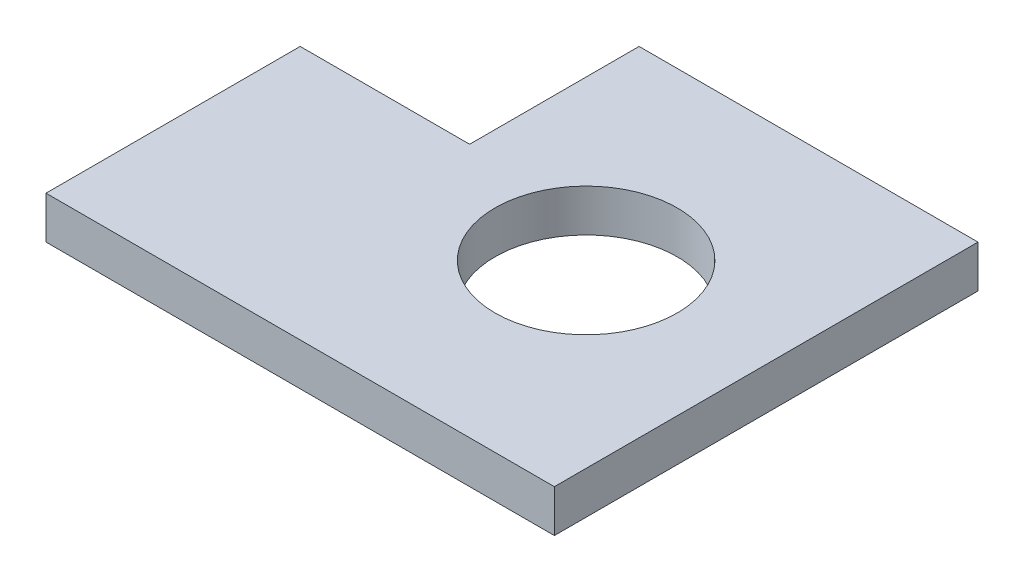
ISO-10303-21;
HEADER;
FILE_DESCRIPTION(('STEP AP214'),'2;1');
FILE_NAME('part.step','',(''),(''),'','','');
FILE_SCHEMA(('AUTOMOTIVE_DESIGN { 1 0 10303 214 1 1 1 1 }'));
ENDSEC;
DATA;
#1=APPLICATION_CONTEXT('core data for automotive mechanical design processes');
#2=APPLICATION_PROTOCOL_DEFINITION('international standard','automotive_design',2000,#1);
#3=PRODUCT_CONTEXT('',#1,'mechanical');
#4=PRODUCT('Part','Part','',(#3));
#5=PRODUCT_RELATED_PRODUCT_CATEGORY('part','',(#4));
#6=PRODUCT_DEFINITION_FORMATION('','',#4);
#7=PRODUCT_DEFINITION_CONTEXT('part definition',#1,'design');
#8=PRODUCT_DEFINITION('design','',#6,#7);
#9=PRODUCT_DEFINITION_SHAPE('','',#8);
#10=(LENGTH_UNIT() NAMED_UNIT(*) SI_UNIT(.MILLI.,.METRE.));
#11=(NAMED_UNIT(*) PLANE_ANGLE_UNIT() SI_UNIT($,.RADIAN.));
#12=(NAMED_UNIT(*) SI_UNIT($,.STERADIAN.) SOLID_ANGLE_UNIT());
#13=UNCERTAINTY_MEASURE_WITH_UNIT(LENGTH_MEASURE(1.E-05),#10,'distance_accuracy_value','');
#14=(GEOMETRIC_REPRESENTATION_CONTEXT(3) GLOBAL_UNCERTAINTY_ASSIGNED_CONTEXT((#13)) GLOBAL_UNIT_ASSIGNED_CONTEXT((#10,
#11,#12)) REPRESENTATION_CONTEXT('',''));
#15=CARTESIAN_POINT('',(0.,0.,0.));
#16=DIRECTION('',(0.,0.,1.));
#17=DIRECTION('',(1.,0.,0.));
#18=AXIS2_PLACEMENT_3D('',#15,#16,#17);
#19=CARTESIAN_POINT('',(0.,10.,0.));
#20=DIRECTION('',(0.,1.,0.));
#21=DIRECTION('',(0.,0.,1.));
#22=AXIS2_PLACEMENT_3D('',#19,#20,#21);
#23=PLANE('',#22);
#24=DIRECTION('',(0.,0.,1.));
#25=VECTOR('',#24,1.);
#26=CARTESIAN_POINT('',(0.,10.,-60.));
#27=LINE('',#26,#25);
#28=CARTESIAN_POINT('',(0.,10.,-60.));
#29=VERTEX_POINT('',#28);
#30=CARTESIAN_POINT('',(0.,10.,0.));
#31=VERTEX_POINT('',#30);
#32=EDGE_CURVE('E131',#29,#31,#27,.T.);
#33=ORIENTED_EDGE('',*,*,#32,.T.);
#34=DIRECTION('',(1.,0.,0.));
#35=VECTOR('',#34,1.);
#36=CARTESIAN_POINT('',(0.,10.,0.));
#37=LINE('',#36,#35);
#38=CARTESIAN_POINT('',(120.,10.,0.));
#39=VERTEX_POINT('',#38);
#40=EDGE_CURVE('E89',#31,#39,#37,.T.);
#41=ORIENTED_EDGE('',*,*,#40,.T.);
#42=DIRECTION('',(0.,0.,-1.));
#43=VECTOR('',#42,1.);
#44=CARTESIAN_POINT('',(120.,10.,0.));
#45=LINE('',#44,#43);
#46=CARTESIAN_POINT('',(120.,10.,-100.));
#47=VERTEX_POINT('',#46);
#48=EDGE_CURVE('E102',#39,#47,#45,.T.);
#49=ORIENTED_EDGE('',*,*,#48,.T.);
#50=DIRECTION('',(-1.,0.,0.));
#51=VECTOR('',#50,1.);
#52=CARTESIAN_POINT('',(120.,10.,-100.));
#53=LINE('',#52,#51);
#54=CARTESIAN_POINT('',(40.,10.,-100.));
#55=VERTEX_POINT('',#54);
#56=EDGE_CURVE('E96',#47,#55,#53,.T.);
#57=ORIENTED_EDGE('',*,*,#56,.T.);
#58=DIRECTION('',(0.,0.,1.));
#59=VECTOR('',#58,1.);
#60=CARTESIAN_POINT('',(40.,10.,-100.));
#61=LINE('',#60,#59);
#62=CARTESIAN_POINT('',(40.,10.,-60.));
#63=VERTEX_POINT('',#62);
#64=EDGE_CURVE('E100',#55,#63,#61,.T.);
#65=ORIENTED_EDGE('',*,*,#64,.T.);
#66=DIRECTION('',(-1.,0.,0.));
#67=VECTOR('',#66,1.);
#68=CARTESIAN_POINT('',(40.,10.,-60.));
#69=LINE('',#68,#67);
#70=EDGE_CURVE('E52',#63,#29,#69,.T.);
#71=ORIENTED_EDGE('',*,*,#70,.T.);
#72=EDGE_LOOP('',(#33,#41,#49,#57,#65,#71));
#73=FACE_BOUND('',#72,.T.);
#74=CARTESIAN_POINT('',(77.4999999999993,10.,-49.9999999999994));
#75=DIRECTION('',(0.,1.,0.));
#76=DIRECTION('',(0.,0.,1.));
#77=AXIS2_PLACEMENT_3D('',#74,#75,#76);
#78=CIRCLE('',#77,21.5);
#79=CARTESIAN_POINT('',(77.4999999999993,10.,-28.4999999999995));
#80=VERTEX_POINT('',#79);
#81=EDGE_CURVE('E124',#80,#80,#78,.T.);
#82=ORIENTED_EDGE('',*,*,#81,.F.);
#83=EDGE_LOOP('',(#82));
#84=FACE_BOUND('',#83,.T.);
#85=ADVANCED_FACE('F35',(#73,#84),#23,.T.);
#86=CARTESIAN_POINT('',(0.,0.,0.));
#87=DIRECTION('',(0.,1.,0.));
#88=DIRECTION('',(0.,0.,1.));
#89=AXIS2_PLACEMENT_3D('',#86,#87,#88);
#90=PLANE('',#89);
#91=DIRECTION('',(0.,0.,1.));
#92=VECTOR('',#91,1.);
#93=CARTESIAN_POINT('',(0.,0.,-60.));
#94=LINE('',#93,#92);
#95=CARTESIAN_POINT('',(0.,0.,-60.));
#96=VERTEX_POINT('',#95);
#97=CARTESIAN_POINT('',(0.,0.,0.));
#98=VERTEX_POINT('',#97);
#99=EDGE_CURVE('E120',#96,#98,#94,.T.);
#100=ORIENTED_EDGE('',*,*,#99,.F.);
#101=DIRECTION('',(-1.,0.,0.));
#102=VECTOR('',#101,1.);
#103=CARTESIAN_POINT('',(40.,0.,-60.));
#104=LINE('',#103,#102);
#105=CARTESIAN_POINT('',(40.,0.,-60.));
#106=VERTEX_POINT('',#105);
#107=EDGE_CURVE('E81',#106,#96,#104,.T.);
#108=ORIENTED_EDGE('',*,*,#107,.F.);
#109=DIRECTION('',(0.,0.,1.));
#110=VECTOR('',#109,1.);
#111=CARTESIAN_POINT('',(40.,0.,-100.));
#112=LINE('',#111,#110);
#113=CARTESIAN_POINT('',(40.,0.,-100.));
#114=VERTEX_POINT('',#113);
#115=EDGE_CURVE('E75',#114,#106,#112,.T.);
#116=ORIENTED_EDGE('',*,*,#115,.F.);
#117=DIRECTION('',(-1.,0.,0.));
#118=VECTOR('',#117,1.);
#119=CARTESIAN_POINT('',(120.,0.,-100.));
#120=LINE('',#119,#118);
#121=CARTESIAN_POINT('',(120.,0.,-100.));
#122=VERTEX_POINT('',#121);
#123=EDGE_CURVE('E110',#122,#114,#120,.T.);
#124=ORIENTED_EDGE('',*,*,#123,.F.);
#125=DIRECTION('',(0.,0.,-1.));
#126=VECTOR('',#125,1.);
#127=CARTESIAN_POINT('',(120.,0.,0.));
#128=LINE('',#127,#126);
#129=CARTESIAN_POINT('',(120.,0.,0.));
#130=VERTEX_POINT('',#129);
#131=EDGE_CURVE('E126',#130,#122,#128,.T.);
#132=ORIENTED_EDGE('',*,*,#131,.F.);
#133=DIRECTION('',(1.,0.,0.));
#134=VECTOR('',#133,1.);
#135=CARTESIAN_POINT('',(0.,0.,0.));
#136=LINE('',#135,#134);
#137=EDGE_CURVE('E123',#98,#130,#136,.T.);
#138=ORIENTED_EDGE('',*,*,#137,.F.);
#139=EDGE_LOOP('',(#100,#108,#116,#124,#132,#138));
#140=FACE_BOUND('',#139,.T.);
#141=CARTESIAN_POINT('',(77.4999999999993,0.,-49.9999999999994));
#142=DIRECTION('',(0.,1.,0.));
#143=DIRECTION('',(0.,0.,1.));
#144=AXIS2_PLACEMENT_3D('',#141,#142,#143);
#145=CIRCLE('',#144,21.5);
#146=CARTESIAN_POINT('',(77.4999999999993,0.,-28.4999999999995));
#147=VERTEX_POINT('',#146);
#148=EDGE_CURVE('E224',#147,#147,#145,.T.);
#149=ORIENTED_EDGE('',*,*,#148,.T.);
#150=EDGE_LOOP('',(#149));
#151=FACE_BOUND('',#150,.T.);
#152=ADVANCED_FACE('F140',(#140,#151),#90,.F.);
#153=CARTESIAN_POINT('',(0.,10.,-60.));
#154=DIRECTION('',(1.,0.,0.));
#155=DIRECTION('',(0.,0.,-1.));
#156=AXIS2_PLACEMENT_3D('',#153,#154,#155);
#157=PLANE('',#156);
#158=ORIENTED_EDGE('',*,*,#99,.T.);
#159=DIRECTION('',(0.,-1.,0.));
#160=VECTOR('',#159,1.);
#161=CARTESIAN_POINT('',(0.,10.,0.));
#162=LINE('',#161,#160);
#163=EDGE_CURVE('E11',#31,#98,#162,.T.);
#164=ORIENTED_EDGE('',*,*,#163,.F.);
#165=ORIENTED_EDGE('',*,*,#32,.F.);
#166=DIRECTION('',(0.,-1.,0.));
#167=VECTOR('',#166,1.);
#168=CARTESIAN_POINT('',(0.,10.,-60.));
#169=LINE('',#168,#167);
#170=EDGE_CURVE('E116',#29,#96,#169,.T.);
#171=ORIENTED_EDGE('',*,*,#170,.T.);
#172=EDGE_LOOP('',(#158,#164,#165,#171));
#173=FACE_BOUND('',#172,.T.);
#174=ADVANCED_FACE('F37',(#173),#157,.F.);
#175=CARTESIAN_POINT('',(0.,10.,0.));
#176=DIRECTION('',(0.,0.,-1.));
#177=DIRECTION('',(-1.,0.,0.));
#178=AXIS2_PLACEMENT_3D('',#175,#176,#177);
#179=PLANE('',#178);
#180=ORIENTED_EDGE('',*,*,#137,.T.);
#181=DIRECTION('',(0.,-1.,0.));
#182=VECTOR('',#181,1.);
#183=CARTESIAN_POINT('',(120.,10.,0.));
#184=LINE('',#183,#182);
#185=EDGE_CURVE('E44',#39,#130,#184,.T.);
#186=ORIENTED_EDGE('',*,*,#185,.F.);
#187=ORIENTED_EDGE('',*,*,#40,.F.);
#188=ORIENTED_EDGE('',*,*,#163,.T.);
#189=EDGE_LOOP('',(#180,#186,#187,#188));
#190=FACE_BOUND('',#189,.T.);
#191=ADVANCED_FACE('F165',(#190),#179,.F.);
#192=CARTESIAN_POINT('',(120.,10.,0.));
#193=DIRECTION('',(-1.,0.,0.));
#194=DIRECTION('',(0.,0.,1.));
#195=AXIS2_PLACEMENT_3D('',#192,#193,#194);
#196=PLANE('',#195);
#197=ORIENTED_EDGE('',*,*,#131,.T.);
#198=DIRECTION('',(0.,-1.,0.));
#199=VECTOR('',#198,1.);
#200=CARTESIAN_POINT('',(120.,10.,-100.));
#201=LINE('',#200,#199);
#202=EDGE_CURVE('E111',#47,#122,#201,.T.);
#203=ORIENTED_EDGE('',*,*,#202,.F.);
#204=ORIENTED_EDGE('',*,*,#48,.F.);
#205=ORIENTED_EDGE('',*,*,#185,.T.);
#206=EDGE_LOOP('',(#197,#203,#204,#205));
#207=FACE_BOUND('',#206,.T.);
#208=ADVANCED_FACE('F137',(#207),#196,.F.);
#209=CARTESIAN_POINT('',(120.,10.,-100.));
#210=DIRECTION('',(0.,0.,1.));
#211=DIRECTION('',(1.,0.,0.));
#212=AXIS2_PLACEMENT_3D('',#209,#210,#211);
#213=PLANE('',#212);
#214=ORIENTED_EDGE('',*,*,#123,.T.);
#215=DIRECTION('',(0.,-1.,0.));
#216=VECTOR('',#215,1.);
#217=CARTESIAN_POINT('',(40.,10.,-100.));
#218=LINE('',#217,#216);
#219=EDGE_CURVE('E107',#55,#114,#218,.T.);
#220=ORIENTED_EDGE('',*,*,#219,.F.);
#221=ORIENTED_EDGE('',*,*,#56,.F.);
#222=ORIENTED_EDGE('',*,*,#202,.T.);
#223=EDGE_LOOP('',(#214,#220,#221,#222));
#224=FACE_BOUND('',#223,.T.);
#225=ADVANCED_FACE('F108',(#224),#213,.F.);
#226=CARTESIAN_POINT('',(40.,10.,-100.));
#227=DIRECTION('',(1.,0.,0.));
#228=DIRECTION('',(0.,0.,-1.));
#229=AXIS2_PLACEMENT_3D('',#226,#227,#228);
#230=PLANE('',#229);
#231=ORIENTED_EDGE('',*,*,#115,.T.);
#232=DIRECTION('',(0.,-1.,0.));
#233=VECTOR('',#232,1.);
#234=CARTESIAN_POINT('',(40.,10.,-60.));
#235=LINE('',#234,#233);
#236=EDGE_CURVE('E112',#63,#106,#235,.T.);
#237=ORIENTED_EDGE('',*,*,#236,.F.);
#238=ORIENTED_EDGE('',*,*,#64,.F.);
#239=ORIENTED_EDGE('',*,*,#219,.T.);
#240=EDGE_LOOP('',(#231,#237,#238,#239));
#241=FACE_BOUND('',#240,.T.);
#242=ADVANCED_FACE('F114',(#241),#230,.F.);
#243=CARTESIAN_POINT('',(40.,10.,-60.));
#244=DIRECTION('',(0.,0.,1.));
#245=DIRECTION('',(1.,0.,0.));
#246=AXIS2_PLACEMENT_3D('',#243,#244,#245);
#247=PLANE('',#246);
#248=ORIENTED_EDGE('',*,*,#107,.T.);
#249=ORIENTED_EDGE('',*,*,#170,.F.);
#250=ORIENTED_EDGE('',*,*,#70,.F.);
#251=ORIENTED_EDGE('',*,*,#236,.T.);
#252=EDGE_LOOP('',(#248,#249,#250,#251));
#253=FACE_BOUND('',#252,.T.);
#254=ADVANCED_FACE('F145',(#253),#247,.F.);
#255=CARTESIAN_POINT('',(77.4999999999993,10.,-49.9999999999994));
#256=DIRECTION('',(0.,-1.,0.));
#257=DIRECTION('',(0.,0.,-1.));
#258=AXIS2_PLACEMENT_3D('',#255,#256,#257);
#259=CYLINDRICAL_SURFACE('',#258,21.5);
#260=ORIENTED_EDGE('',*,*,#81,.T.);
#261=EDGE_LOOP('',(#260));
#262=FACE_BOUND('',#261,.T.);
#263=ORIENTED_EDGE('',*,*,#148,.F.);
#264=EDGE_LOOP('',(#263));
#265=FACE_BOUND('',#264,.T.);
#266=ADVANCED_FACE('F147',(#262,#265),#259,.F.);
#267=CLOSED_SHELL('',(#85,#152,#174,#191,#208,#225,#242,#254,#266));
#268=MANIFOLD_SOLID_BREP('B2',#267);
#269=ADVANCED_BREP_SHAPE_REPRESENTATION('',(#18,#268),#14);
#270=SHAPE_DEFINITION_REPRESENTATION(#9,#269);
ENDSEC;
END-ISO-10303-21;
